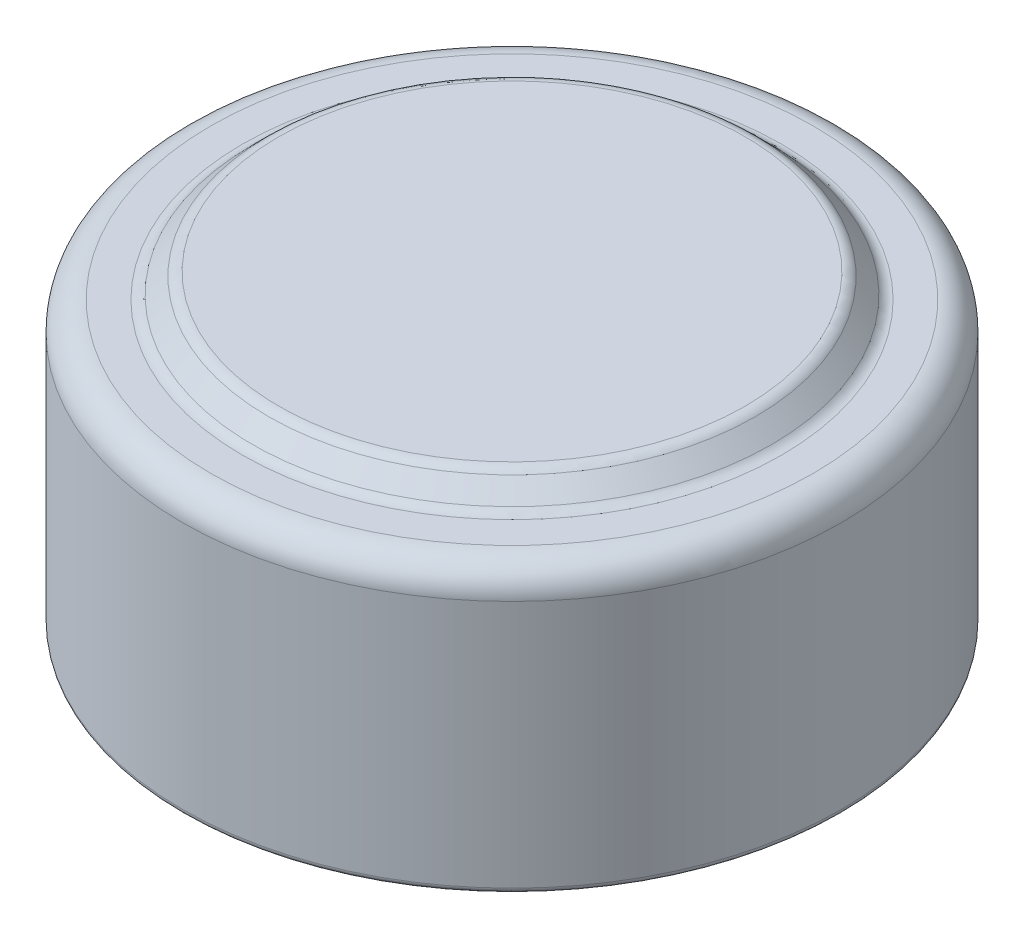
ISO-10303-21;
HEADER;
FILE_DESCRIPTION(('STEP AP214'),'2;1');
FILE_NAME('part.step','',(''),(''),'','','');
FILE_SCHEMA(('AUTOMOTIVE_DESIGN { 1 0 10303 214 1 1 1 1 }'));
ENDSEC;
DATA;
#1=APPLICATION_CONTEXT('core data for automotive mechanical design processes');
#2=APPLICATION_PROTOCOL_DEFINITION('international standard','automotive_design',2000,#1);
#3=PRODUCT_CONTEXT('',#1,'mechanical');
#4=PRODUCT('Part','Part','',(#3));
#5=PRODUCT_RELATED_PRODUCT_CATEGORY('part','',(#4));
#6=PRODUCT_DEFINITION_FORMATION('','',#4);
#7=PRODUCT_DEFINITION_CONTEXT('part definition',#1,'design');
#8=PRODUCT_DEFINITION('design','',#6,#7);
#9=PRODUCT_DEFINITION_SHAPE('','',#8);
#10=(LENGTH_UNIT() NAMED_UNIT(*) SI_UNIT(.MILLI.,.METRE.));
#11=(NAMED_UNIT(*) PLANE_ANGLE_UNIT() SI_UNIT($,.RADIAN.));
#12=(NAMED_UNIT(*) SI_UNIT($,.STERADIAN.) SOLID_ANGLE_UNIT());
#13=UNCERTAINTY_MEASURE_WITH_UNIT(LENGTH_MEASURE(1.E-05),#10,'distance_accuracy_value','');
#14=(GEOMETRIC_REPRESENTATION_CONTEXT(3) GLOBAL_UNCERTAINTY_ASSIGNED_CONTEXT((#13)) GLOBAL_UNIT_ASSIGNED_CONTEXT((#10,
#11,#12)) REPRESENTATION_CONTEXT('',''));
#15=CARTESIAN_POINT('',(0.,0.,0.));
#16=DIRECTION('',(0.,0.,1.));
#17=DIRECTION('',(1.,0.,0.));
#18=AXIS2_PLACEMENT_3D('',#15,#16,#17);
#19=CARTESIAN_POINT('',(0.,0.,0.));
#20=DIRECTION('',(0.,-1.,0.));
#21=DIRECTION('',(1.,0.,0.));
#22=AXIS2_PLACEMENT_3D('',#19,#20,#21);
#23=PLANE('',#22);
#24=DIRECTION('',(-1.,0.,0.));
#25=VECTOR('',#24,1.);
#26=CARTESIAN_POINT('',(-0.25,0.,2.));
#27=LINE('',#26,#25);
#28=CARTESIAN_POINT('',(0.25,0.,2.));
#29=VERTEX_POINT('',#28);
#30=CARTESIAN_POINT('',(-0.25,0.,2.));
#31=VERTEX_POINT('',#30);
#32=EDGE_CURVE('E1611',#29,#31,#27,.T.);
#33=ORIENTED_EDGE('',*,*,#32,.T.);
#34=DIRECTION('',(0.,0.,-1.));
#35=VECTOR('',#34,1.);
#36=CARTESIAN_POINT('',(-0.25,0.,2.));
#37=LINE('',#36,#35);
#38=CARTESIAN_POINT('',(-0.25,0.,0.25));
#39=VERTEX_POINT('',#38);
#40=EDGE_CURVE('E13',#31,#39,#37,.T.);
#41=ORIENTED_EDGE('',*,*,#40,.T.);
#42=DIRECTION('',(-1.,0.,0.));
#43=VECTOR('',#42,1.);
#44=CARTESIAN_POINT('',(-2.,0.,0.25));
#45=LINE('',#44,#43);
#46=CARTESIAN_POINT('',(-2.,0.,0.25));
#47=VERTEX_POINT('',#46);
#48=EDGE_CURVE('E1238',#39,#47,#45,.T.);
#49=ORIENTED_EDGE('',*,*,#48,.T.);
#50=DIRECTION('',(0.,0.,-1.));
#51=VECTOR('',#50,1.);
#52=CARTESIAN_POINT('',(-2.,0.,0.25));
#53=LINE('',#52,#51);
#54=CARTESIAN_POINT('',(-2.,0.,-0.25));
#55=VERTEX_POINT('',#54);
#56=EDGE_CURVE('E1638',#47,#55,#53,.T.);
#57=ORIENTED_EDGE('',*,*,#56,.T.);
#58=DIRECTION('',(1.,0.,0.));
#59=VECTOR('',#58,1.);
#60=CARTESIAN_POINT('',(-2.,0.,-0.25));
#61=LINE('',#60,#59);
#62=CARTESIAN_POINT('',(-0.25,0.,-0.25));
#63=VERTEX_POINT('',#62);
#64=EDGE_CURVE('E1635',#55,#63,#61,.T.);
#65=ORIENTED_EDGE('',*,*,#64,.T.);
#66=DIRECTION('',(0.,0.,-1.));
#67=VECTOR('',#66,1.);
#68=CARTESIAN_POINT('',(-0.25,0.,-0.25));
#69=LINE('',#68,#67);
#70=CARTESIAN_POINT('',(-0.25,0.,-2.));
#71=VERTEX_POINT('',#70);
#72=EDGE_CURVE('E1632',#63,#71,#69,.T.);
#73=ORIENTED_EDGE('',*,*,#72,.T.);
#74=DIRECTION('',(1.,0.,0.));
#75=VECTOR('',#74,1.);
#76=CARTESIAN_POINT('',(-0.25,0.,-2.));
#77=LINE('',#76,#75);
#78=CARTESIAN_POINT('',(0.25,0.,-2.));
#79=VERTEX_POINT('',#78);
#80=EDGE_CURVE('E1629',#71,#79,#77,.T.);
#81=ORIENTED_EDGE('',*,*,#80,.T.);
#82=DIRECTION('',(0.,0.,1.));
#83=VECTOR('',#82,1.);
#84=CARTESIAN_POINT('',(0.25,0.,-0.25));
#85=LINE('',#84,#83);
#86=CARTESIAN_POINT('',(0.25,0.,-0.25));
#87=VERTEX_POINT('',#86);
#88=EDGE_CURVE('E1626',#79,#87,#85,.T.);
#89=ORIENTED_EDGE('',*,*,#88,.T.);
#90=DIRECTION('',(1.,0.,0.));
#91=VECTOR('',#90,1.);
#92=CARTESIAN_POINT('',(0.25,0.,-0.25));
#93=LINE('',#92,#91);
#94=CARTESIAN_POINT('',(2.,0.,-0.25));
#95=VERTEX_POINT('',#94);
#96=EDGE_CURVE('E1623',#87,#95,#93,.T.);
#97=ORIENTED_EDGE('',*,*,#96,.T.);
#98=DIRECTION('',(0.,0.,1.));
#99=VECTOR('',#98,1.);
#100=CARTESIAN_POINT('',(2.,0.,0.25));
#101=LINE('',#100,#99);
#102=CARTESIAN_POINT('',(2.,0.,0.25));
#103=VERTEX_POINT('',#102);
#104=EDGE_CURVE('E1620',#95,#103,#101,.T.);
#105=ORIENTED_EDGE('',*,*,#104,.T.);
#106=DIRECTION('',(-1.,0.,0.));
#107=VECTOR('',#106,1.);
#108=CARTESIAN_POINT('',(0.25,0.,0.25));
#109=LINE('',#108,#107);
#110=CARTESIAN_POINT('',(0.25,0.,0.25));
#111=VERTEX_POINT('',#110);
#112=EDGE_CURVE('E1617',#103,#111,#109,.T.);
#113=ORIENTED_EDGE('',*,*,#112,.T.);
#114=DIRECTION('',(0.,0.,1.));
#115=VECTOR('',#114,1.);
#116=CARTESIAN_POINT('',(0.25,0.,2.));
#117=LINE('',#116,#115);
#118=EDGE_CURVE('E1614',#111,#29,#117,.T.);
#119=ORIENTED_EDGE('',*,*,#118,.T.);
#120=EDGE_LOOP('',(#33,#41,#49,#57,#65,#73,#81,#89,#97,#105,#113,#119));
#121=FACE_BOUND('',#120,.T.);
#122=ADVANCED_FACE('F1229',(#121),#23,.T.);
#123=ORIENTED_EDGE('',*,*,#40,.F.);
#124=ORIENTED_EDGE('',*,*,#32,.F.);
#125=ORIENTED_EDGE('',*,*,#118,.F.);
#126=ORIENTED_EDGE('',*,*,#112,.F.);
#127=ORIENTED_EDGE('',*,*,#104,.F.);
#128=ORIENTED_EDGE('',*,*,#96,.F.);
#129=ORIENTED_EDGE('',*,*,#88,.F.);
#130=ORIENTED_EDGE('',*,*,#80,.F.);
#131=ORIENTED_EDGE('',*,*,#72,.F.);
#132=ORIENTED_EDGE('',*,*,#64,.F.);
#133=ORIENTED_EDGE('',*,*,#56,.F.);
#134=ORIENTED_EDGE('',*,*,#48,.F.);
#135=EDGE_LOOP('',(#123,#124,#125,#126,#127,#128,#129,#130,#131,#132,#133,#134));
#136=FACE_BOUND('',#135,.T.);
#137=DIRECTION('',(-0.995540464166135,0.,-0.0943354875318707));
#138=VECTOR('',#137,1.);
#139=CARTESIAN_POINT('',(-0.579137112303286,0.,3.93981514695249));
#140=LINE('',#139,#138);
#141=CARTESIAN_POINT('',(-0.579137112303286,0.,3.93981514695249));
#142=VERTEX_POINT('',#141);
#143=CARTESIAN_POINT('',(-0.67849608666226,0.,3.93040008284993));
#144=VERTEX_POINT('',#143);
#145=EDGE_CURVE('E1517',#142,#144,#140,.T.);
#146=ORIENTED_EDGE('',*,*,#145,.T.);
#147=DIRECTION('',(-0.0958308297289828,0.,0.995397635155647));
#148=VECTOR('',#147,1.);
#149=CARTESIAN_POINT('',(-0.67849608666226,0.,3.93040008284993));
#150=LINE('',#149,#148);
#151=CARTESIAN_POINT('',(-0.774249291790466,0.,4.92499142900377));
#152=VERTEX_POINT('',#151);
#153=EDGE_CURVE('E1563',#144,#152,#150,.T.);
#154=ORIENTED_EDGE('',*,*,#153,.T.);
#155=DIRECTION('',(0.995418244796923,0.,0.0956165149198263));
#156=VECTOR('',#155,1.);
#157=CARTESIAN_POINT('',(-0.774249291790466,0.,4.92499142900377));
#158=LINE('',#157,#156);
#159=CARTESIAN_POINT('',(-0.576132304610978,0.,4.94402187772172));
#160=VERTEX_POINT('',#159);
#161=EDGE_CURVE('E1557',#152,#160,#158,.T.);
#162=ORIENTED_EDGE('',*,*,#161,.T.);
#163=CARTESIAN_POINT('',(-0.576132304610978,0.,4.94402187772172));
#164=CARTESIAN_POINT('',(-0.562848063113638,0.,4.94526764360899));
#165=CARTESIAN_POINT('',(-0.537428066731086,0.,4.94765147292693));
#166=CARTESIAN_POINT('',(-0.500955931397643,0.,4.95037639883472));
#167=CARTESIAN_POINT('',(-0.467777907571374,0.,4.95269989612441));
#168=CARTESIAN_POINT('',(-0.437923433262967,0.,4.95408980892578));
#169=CARTESIAN_POINT('',(-0.41127038551046,0.,4.95478894246751));
#170=CARTESIAN_POINT('',(-0.387961257945064,0.,4.9545206027815));
#171=CARTESIAN_POINT('',(-0.367891310391459,0.,4.95396066194312));
#172=CARTESIAN_POINT('',(-0.355708054657356,0.,4.95263652042265));
#173=CARTESIAN_POINT('',(-0.35017076614944,0.,4.95203469823454));
#174=B_SPLINE_CURVE_WITH_KNOTS('',3,(#163,#164,#165,#166,#167,#168,#169,#170,#171,#172,#173),
.UNSPECIFIED.,.F.,.F.,(4,1,1,1,1,1,1,1,4),(0.,0.176765299281133,0.33824838769957,
0.484540683418533,0.617383536305086,0.73418831624917,0.837696878102558,0.926233247393305,1.),.UNSPECIFIED.);
#175=CARTESIAN_POINT('',(-0.35017076614944,0.,4.95203469823454));
#176=VERTEX_POINT('',#175);
#177=EDGE_CURVE('E1549',#160,#176,#174,.T.);
#178=ORIENTED_EDGE('',*,*,#177,.T.);
#179=CARTESIAN_POINT('',(-0.35017076614944,0.,4.95203469823454));
#180=CARTESIAN_POINT('',(-0.34273809616172,0.,4.95087510297817));
#181=CARTESIAN_POINT('',(-0.328101930189746,0.,4.9485916666544));
#182=CARTESIAN_POINT('',(-0.306728966277622,0.,4.94331661380554));
#183=CARTESIAN_POINT('',(-0.286260255454316,0.,4.93656739672086));
#184=CARTESIAN_POINT('',(-0.266772228412674,0.,4.92802337936674));
#185=CARTESIAN_POINT('',(-0.248048764176811,0.,4.91828945151708));
#186=CARTESIAN_POINT('',(-0.230346224854302,0.,4.90673222610036));
#187=CARTESIAN_POINT('',(-0.213465975747795,0.,4.89373881107627));
#188=CARTESIAN_POINT('',(-0.19775043201894,0.,4.87909501931557));
#189=CARTESIAN_POINT('',(-0.183054752561447,0.,4.86335310121902));
#190=CARTESIAN_POINT('',(-0.170006725116365,0.,4.84622685891086));
#191=CARTESIAN_POINT('',(-0.158540860090183,0.,4.82801933861695));
#192=CARTESIAN_POINT('',(-0.148938303488982,0.,4.80855361890555));
#193=CARTESIAN_POINT('',(-0.140660521227825,0.,4.78818249208818));
#194=CARTESIAN_POINT('',(-0.134230443257437,0.,4.76658528988735));
#195=CARTESIAN_POINT('',(-0.129666606272355,0.,4.74383268859503));
#196=CARTESIAN_POINT('',(-0.127777184491831,0.,4.72822520828457));
#197=CARTESIAN_POINT('',(-0.126813394354568,0.,4.72026386490121));
#198=B_SPLINE_CURVE_WITH_KNOTS('',3,(#179,#180,#181,#182,#183,#184,#185,#186,#187,#188,#189,
#190,#191,#192,#193,#194,#195,#196,#197),.UNSPECIFIED.,.F.,.F.,(4,1,1,1,1,1,1,1,1,1,1,1,1,1,1,1,
4),(0.,0.0645355136999793,0.127081182288468,0.188695807908852,0.249270302092627,
0.309510450893333,0.369595028291359,0.430461579765324,0.492102849549383,0.553744119333444,
0.615064895075256,0.676599518983968,0.73810745253189,0.801105664637679,0.865107194918374,
0.931191459490145,1.),.UNSPECIFIED.);
#199=CARTESIAN_POINT('',(-0.126813394354568,0.,4.72026386490121));
#200=VERTEX_POINT('',#199);
#201=EDGE_CURVE('E1541',#176,#200,#198,.T.);
#202=ORIENTED_EDGE('',*,*,#201,.T.);
#203=CARTESIAN_POINT('',(-0.126813394354568,0.,4.72026386490121));
#204=CARTESIAN_POINT('',(-0.125984217964188,0.,4.70711045702879));
#205=CARTESIAN_POINT('',(-0.124360629045319,0.,4.68135510808883));
#206=CARTESIAN_POINT('',(-0.128095525414482,0.,4.64342918502035));
#207=CARTESIAN_POINT('',(-0.136765342544982,0.,4.60747873156485));
#208=CARTESIAN_POINT('',(-0.15034614854203,0.,4.57371505268606));
#209=CARTESIAN_POINT('',(-0.168894568379458,0.,4.54277616787755));
#210=CARTESIAN_POINT('',(-0.191839853937776,0.,4.51478873351264));
#211=CARTESIAN_POINT('',(-0.219590675391178,0.,4.49055554112114));
#212=CARTESIAN_POINT('',(-0.246024964797724,0.,4.47321154731204));
#213=CARTESIAN_POINT('',(-0.26947269817296,0.,4.46098748914535));
#214=CARTESIAN_POINT('',(-0.289274132221101,0.,4.45291233535171));
#215=CARTESIAN_POINT('',(-0.310696993447914,0.,4.44524127220123));
#216=CARTESIAN_POINT('',(-0.333992806856697,0.,4.43850671105934));
#217=CARTESIAN_POINT('',(-0.359036647226361,0.,4.43243319715856));
#218=CARTESIAN_POINT('',(-0.385899254801166,0.,4.4276277996647));
#219=CARTESIAN_POINT('',(-0.414460278621418,0.,4.42306459927358));
#220=CARTESIAN_POINT('',(-0.434160400731547,0.,4.42089971050956));
#221=CARTESIAN_POINT('',(-0.444321407175081,0.,4.41978309567044));
#222=B_SPLINE_CURVE_WITH_KNOTS('',3,(#203,#204,#205,#206,#207,#208,#209,#210,#211,#212,#213,
#214,#215,#216,#217,#218,#219,#220,#221),.UNSPECIFIED.,.F.,.F.,(4,1,1,1,1,1,1,1,1,1,1,1,1,1,1,1,
4),(0.,0.0794615546542025,0.155591622131733,0.229016280946953,0.302074873554491,
0.374386787345154,0.445973745701806,0.519654671405812,0.59590417205232,0.636289052151415,
0.67911111824488,0.724882479331101,0.773609703025196,0.825428529069993,0.880376464269299,
0.938300102376877,1.),.UNSPECIFIED.);
#223=CARTESIAN_POINT('',(-0.444321407175081,0.,4.41978309567044));
#224=VERTEX_POINT('',#223);
#225=EDGE_CURVE('E1536',#200,#224,#222,.T.);
#226=ORIENTED_EDGE('',*,*,#225,.T.);
#227=DIRECTION('',(0.684417411691212,0.,-0.729090396709422));
#228=VECTOR('',#227,1.);
#229=CARTESIAN_POINT('',(-0.444321407175081,0.,4.41978309567044));
#230=LINE('',#229,#228);
#231=CARTESIAN_POINT('',(-0.0422781379443117,0.,3.99149783926018));
#232=VERTEX_POINT('',#231);
#233=EDGE_CURVE('E1533',#224,#232,#230,.T.);
#234=ORIENTED_EDGE('',*,*,#233,.T.);
#235=DIRECTION('',(-0.9954149678096,0.,-0.0956506239426177));
#236=VECTOR('',#235,1.);
#237=CARTESIAN_POINT('',(-0.0422781379443117,0.,3.99149783926018));
#238=LINE('',#237,#236);
#239=CARTESIAN_POINT('',(-0.165274932816106,0.,3.97967892900377));
#240=VERTEX_POINT('',#239);
#241=EDGE_CURVE('E1530',#232,#240,#238,.T.);
#242=ORIENTED_EDGE('',*,*,#241,.T.);
#243=DIRECTION('',(-0.6838730169942,0.,0.729601053060678));
#244=VECTOR('',#243,1.);
#245=CARTESIAN_POINT('',(-0.165274932816106,0.,3.97967892900377));
#246=LINE('',#245,#244);
#247=CARTESIAN_POINT('',(-0.566717240508414,0.,4.40796418541403));
#248=VERTEX_POINT('',#247);
#249=EDGE_CURVE('E1527',#240,#248,#246,.T.);
#250=ORIENTED_EDGE('',*,*,#249,.T.);
#251=DIRECTION('',(-0.995175000159784,0.,-0.0981158450861767));
#252=VECTOR('',#251,1.);
#253=CARTESIAN_POINT('',(-0.566717240508414,0.,4.40796418541403));
#254=LINE('',#253,#252);
#255=CARTESIAN_POINT('',(-0.62360826614944,0.,4.40235521105506));
#256=VERTEX_POINT('',#255);
#257=EDGE_CURVE('E1524',#248,#256,#254,.T.);
#258=ORIENTED_EDGE('',*,*,#257,.T.);
#259=DIRECTION('',(0.0957041922041449,0.,-0.995409818916084));
#260=VECTOR('',#259,1.);
#261=CARTESIAN_POINT('',(-0.62360826614944,0.,4.40235521105506));
#262=LINE('',#261,#260);
#263=EDGE_CURVE('E1521',#256,#142,#262,.T.);
#264=ORIENTED_EDGE('',*,*,#263,.T.);
#265=EDGE_LOOP('',(#146,#154,#162,#178,#202,#226,#234,#242,#250,#258,#264));
#266=FACE_BOUND('',#265,.T.);
#267=DIRECTION('',(-0.955815530348748,0.,0.293967127318925));
#268=VECTOR('',#267,1.);
#269=CARTESIAN_POINT('',(1.35736434889878,0.,3.9895496881155));
#270=LINE('',#269,#268);
#271=CARTESIAN_POINT('',(1.35736434889878,0.,3.9895496881155));
#272=VERTEX_POINT('',#271);
#273=CARTESIAN_POINT('',(0.904039028385959,0.,4.12897276503858));
#274=VERTEX_POINT('',#273);
#275=EDGE_CURVE('E1426',#272,#274,#270,.T.);
#276=ORIENTED_EDGE('',*,*,#275,.T.);
#277=DIRECTION('',(0.790349486385174,0.,0.61265625710564));
#278=VECTOR('',#277,1.);
#279=CARTESIAN_POINT('',(0.904039028385959,0.,4.12897276503858));
#280=LINE('',#279,#278);
#281=CARTESIAN_POINT('',(1.66405505402698,0.,4.7181153932437));
#282=VERTEX_POINT('',#281);
#283=EDGE_CURVE('E1433',#274,#282,#280,.T.);
#284=ORIENTED_EDGE('',*,*,#283,.T.);
#285=DIRECTION('',(0.95447997803502,0.,-0.298274993135977));
#286=VECTOR('',#285,1.);
#287=CARTESIAN_POINT('',(1.66405505402698,0.,4.7181153932437));
#288=LINE('',#287,#286);
#289=CARTESIAN_POINT('',(1.68328582325775,0.,4.71210577785909));
#290=VERTEX_POINT('',#289);
#291=EDGE_CURVE('E1461',#282,#290,#288,.T.);
#292=ORIENTED_EDGE('',*,*,#291,.T.);
#293=DIRECTION('',(-0.29406549008956,0.,-0.955785272714738));
#294=VECTOR('',#293,1.);
#295=CARTESIAN_POINT('',(1.68328582325775,0.,4.71210577785909));
#296=LINE('',#295,#294);
#297=CARTESIAN_POINT('',(1.47996050274493,0.,4.05124840606422));
#298=VERTEX_POINT('',#297);
#299=EDGE_CURVE('E1458',#290,#298,#296,.T.);
#300=ORIENTED_EDGE('',*,*,#299,.T.);
#301=DIRECTION('',(0.955923177176651,0.,-0.293616892117088));
#302=VECTOR('',#301,1.);
#303=CARTESIAN_POINT('',(1.47996050274493,0.,4.05124840606422));
#304=LINE('',#303,#302);
#305=CARTESIAN_POINT('',(1.59474415659109,0.,4.01599199580781));
#306=VERTEX_POINT('',#305);
#307=EDGE_CURVE('E1455',#298,#306,#304,.T.);
#308=ORIENTED_EDGE('',*,*,#307,.T.);
#309=DIRECTION('',(-0.292753571503899,0.,-0.956187924192578));
#310=VECTOR('',#309,1.);
#311=CARTESIAN_POINT('',(1.59474415659109,0.,4.01599199580781));
#312=LINE('',#311,#310);
#313=CARTESIAN_POINT('',(1.56689960530904,0.,3.92504648298729));
#314=VERTEX_POINT('',#313);
#315=EDGE_CURVE('E1452',#306,#314,#312,.T.);
#316=ORIENTED_EDGE('',*,*,#315,.T.);
#317=DIRECTION('',(-0.955923177176653,0.,0.293616892117082));
#318=VECTOR('',#317,1.);
#319=CARTESIAN_POINT('',(1.56689960530904,0.,3.92504648298729));
#320=LINE('',#319,#318);
#321=CARTESIAN_POINT('',(1.45211595146288,0.,3.9603028932437));
#322=VERTEX_POINT('',#321);
#323=EDGE_CURVE('E1449',#314,#322,#320,.T.);
#324=ORIENTED_EDGE('',*,*,#323,.T.);
#325=DIRECTION('',(-0.294268837701824,0.,-0.955722685279374));
#326=VECTOR('',#325,1.);
#327=CARTESIAN_POINT('',(1.45211595146288,0.,3.9603028932437));
#328=LINE('',#327,#326);
#329=CARTESIAN_POINT('',(1.38420729761673,0.,3.73975000862832));
#330=VERTEX_POINT('',#329);
#331=EDGE_CURVE('E1446',#322,#330,#328,.T.);
#332=ORIENTED_EDGE('',*,*,#331,.T.);
#333=DIRECTION('',(-0.955516559654642,0.,0.294937458159787));
#334=VECTOR('',#333,1.);
#335=CARTESIAN_POINT('',(1.38420729761673,0.,3.73975000862832));
#336=LINE('',#335,#334);
#337=CARTESIAN_POINT('',(1.28945569505263,0.,3.76899680350011));
#338=VERTEX_POINT('',#337);
#339=EDGE_CURVE('E1428',#330,#338,#336,.T.);
#340=ORIENTED_EDGE('',*,*,#339,.T.);
#341=DIRECTION('',(0.294268837701825,0.,0.955722685279374));
#342=VECTOR('',#341,1.);
#343=CARTESIAN_POINT('',(1.28945569505263,0.,3.76899680350011));
#344=LINE('',#343,#342);
#345=EDGE_CURVE('E1422',#338,#272,#344,.T.);
#346=ORIENTED_EDGE('',*,*,#345,.T.);
#347=EDGE_LOOP('',(#276,#284,#292,#300,#308,#316,#324,#332,#340,#346));
#348=FACE_BOUND('',#347,.T.);
#349=CARTESIAN_POINT('',(0.,0.,0.));
#350=DIRECTION('',(0.,1.,0.));
#351=DIRECTION('',(-1.,0.,0.));
#352=AXIS2_PLACEMENT_3D('',#349,#350,#351);
#353=CIRCLE('',#352,5.7);
#354=CARTESIAN_POINT('',(-5.7,0.,0.));
#355=VERTEX_POINT('',#354);
#356=EDGE_CURVE('E1435',#355,#355,#353,.T.);
#357=ORIENTED_EDGE('',*,*,#356,.F.);
#358=EDGE_LOOP('',(#357));
#359=FACE_BOUND('',#358,.T.);
#360=DIRECTION('',(-0.994526294566502,0.,0.104486599216473));
#361=VECTOR('',#360,1.);
#362=CARTESIAN_POINT('',(0.566861467099969,0.,4.1759104752558));
#363=LINE('',#362,#361);
#364=CARTESIAN_POINT('',(0.566861467099969,0.,4.1759104752558));
#365=VERTEX_POINT('',#364);
#366=CARTESIAN_POINT('',(0.0959079414589436,0.,4.22538964192246));
#367=VERTEX_POINT('',#366);
#368=EDGE_CURVE('E1476',#365,#367,#363,.T.);
#369=ORIENTED_EDGE('',*,*,#368,.T.);
#370=DIRECTION('',(0.657706516535951,0.,0.753274278139208));
#371=VECTOR('',#370,1.);
#372=CARTESIAN_POINT('',(0.0959079414589436,0.,4.22538964192246));
#373=LINE('',#372,#371);
#374=CARTESIAN_POINT('',(0.7273181978692,0.,4.94854669320451));
#375=VERTEX_POINT('',#374);
#376=EDGE_CURVE('E1504',#367,#375,#373,.T.);
#377=ORIENTED_EDGE('',*,*,#376,.T.);
#378=DIRECTION('',(0.994004355935433,0.,-0.109340479152896));
#379=VECTOR('',#378,1.);
#380=CARTESIAN_POINT('',(0.7273181978692,0.,4.94854669320451));
#381=LINE('',#380,#379);
#382=CARTESIAN_POINT('',(0.747350249151251,0.,4.94634316756349));
#383=VERTEX_POINT('',#382);
#384=EDGE_CURVE('E1501',#375,#383,#381,.T.);
#385=ORIENTED_EDGE('',*,*,#384,.T.);
#386=DIRECTION('',(-0.10447329131765,0.,-0.994527692626634));
#387=VECTOR('',#386,1.);
#388=CARTESIAN_POINT('',(0.747350249151251,0.,4.94634316756349));
#389=LINE('',#388,#387);
#390=CARTESIAN_POINT('',(0.675234864535867,0.,4.25984477012759));
#391=VERTEX_POINT('',#390);
#392=EDGE_CURVE('E1498',#383,#391,#389,.T.);
#393=ORIENTED_EDGE('',*,*,#392,.T.);
#394=DIRECTION('',(0.994614819583192,0.,-0.103640535822116));
#395=VECTOR('',#394,1.);
#396=CARTESIAN_POINT('',(0.675234864535867,0.,4.25984477012759));
#397=LINE('',#396,#395);
#398=CARTESIAN_POINT('',(0.794425569664072,0.,4.24742489833272));
#399=VERTEX_POINT('',#398);
#400=EDGE_CURVE('E1495',#391,#399,#397,.T.);
#401=ORIENTED_EDGE('',*,*,#400,.T.);
#402=DIRECTION('',(-0.105563961257722,0.,-0.994412515047743));
#403=VECTOR('',#402,1.);
#404=CARTESIAN_POINT('',(0.794425569664072,0.,4.24742489833272));
#405=LINE('',#404,#403);
#406=CARTESIAN_POINT('',(0.784409544023046,0.,4.15307393679426));
#407=VERTEX_POINT('',#406);
#408=EDGE_CURVE('E1492',#399,#407,#405,.T.);
#409=ORIENTED_EDGE('',*,*,#408,.T.);
#410=DIRECTION('',(-0.994614819583192,0.,0.103640535822116));
#411=VECTOR('',#410,1.);
#412=CARTESIAN_POINT('',(0.784409544023046,0.,4.15307393679426));
#413=LINE('',#412,#411);
#414=CARTESIAN_POINT('',(0.665218838894841,0.,4.16549380858913));
#415=VERTEX_POINT('',#414);
#416=EDGE_CURVE('E1489',#407,#415,#413,.T.);
#417=ORIENTED_EDGE('',*,*,#416,.T.);
#418=DIRECTION('',(-0.104322744313672,0.,-0.994543495790337));
#419=VECTOR('',#418,1.);
#420=CARTESIAN_POINT('',(0.665218838894841,0.,4.16549380858913));
#421=LINE('',#420,#419);
#422=CARTESIAN_POINT('',(0.64118037735638,0.,3.93632714192246));
#423=VERTEX_POINT('',#422);
#424=EDGE_CURVE('E1486',#415,#423,#421,.T.);
#425=ORIENTED_EDGE('',*,*,#424,.T.);
#426=DIRECTION('',(-0.994438665442402,0.,0.105317333203673));
#427=VECTOR('',#426,1.);
#428=CARTESIAN_POINT('',(0.64118037735638,0.,3.93632714192246));
#429=LINE('',#428,#427);
#430=CARTESIAN_POINT('',(0.542823005561508,0.,3.94674380858913));
#431=VERTEX_POINT('',#430);
#432=EDGE_CURVE('E1483',#423,#431,#429,.T.);
#433=ORIENTED_EDGE('',*,*,#432,.T.);
#434=DIRECTION('',(0.104322744313672,0.,0.994543495790337));
#435=VECTOR('',#434,1.);
#436=CARTESIAN_POINT('',(0.542823005561508,0.,3.94674380858913));
#437=LINE('',#436,#435);
#438=EDGE_CURVE('E1480',#431,#365,#437,.T.);
#439=ORIENTED_EDGE('',*,*,#438,.T.);
#440=EDGE_LOOP('',(#369,#377,#385,#393,#401,#409,#417,#425,#433,#439));
#441=FACE_BOUND('',#440,.T.);
#442=DIRECTION('',(-0.960310420702971,0.,-0.278933497252093));
#443=VECTOR('',#442,1.);
#444=CARTESIAN_POINT('',(-0.838450131693838,0.,3.90844661902257));
#445=LINE('',#444,#443);
#446=CARTESIAN_POINT('',(-0.838450131693838,0.,3.90844661902257));
#447=VERTEX_POINT('',#446);
#448=CARTESIAN_POINT('',(-1.30259275989897,0.,3.77363091389436));
#449=VERTEX_POINT('',#448);
#450=EDGE_CURVE('E1592',#447,#449,#445,.T.);
#451=ORIENTED_EDGE('',*,*,#450,.T.);
#452=DIRECTION('',(-0.278989457181773,0.,0.960294164712782));
#453=VECTOR('',#452,1.);
#454=CARTESIAN_POINT('',(-1.30259275989897,0.,3.77363091389436));
#455=LINE('',#454,#453);
#456=CARTESIAN_POINT('',(-1.58083795220666,0.,4.73136328568924));
#457=VERTEX_POINT('',#456);
#458=EDGE_CURVE('E1608',#449,#457,#455,.T.);
#459=ORIENTED_EDGE('',*,*,#458,.T.);
#460=DIRECTION('',(0.960156349544876,0.,0.279463386561921));
#461=VECTOR('',#460,1.);
#462=CARTESIAN_POINT('',(-1.58083795220666,0.,4.73136328568924));
#463=LINE('',#462,#461);
#464=CARTESIAN_POINT('',(-1.48448378553999,0.,4.75940815748411));
#465=VERTEX_POINT('',#464);
#466=EDGE_CURVE('E1605',#457,#465,#463,.T.);
#467=ORIENTED_EDGE('',*,*,#466,.T.);
#468=DIRECTION('',(0.279035086455506,0.,-0.960280907092695));
#469=VECTOR('',#468,1.);
#470=CARTESIAN_POINT('',(-1.48448378553999,0.,4.75940815748411));
#471=LINE('',#470,#469);
#472=CARTESIAN_POINT('',(-1.23308154195025,0.,3.89422386261231));
#473=VERTEX_POINT('',#472);
#474=EDGE_CURVE('E1602',#465,#473,#471,.T.);
#475=ORIENTED_EDGE('',*,*,#474,.T.);
#476=DIRECTION('',(0.960350744479453,0.,0.278794633337446));
#477=VECTOR('',#476,1.);
#478=CARTESIAN_POINT('',(-1.23308154195025,0.,3.89422386261231));
#479=LINE('',#478,#477);
#480=CARTESIAN_POINT('',(-0.865293080411787,0.,4.00099469594565));
#481=VERTEX_POINT('',#480);
#482=EDGE_CURVE('E1599',#473,#481,#479,.T.);
#483=ORIENTED_EDGE('',*,*,#482,.T.);
#484=DIRECTION('',(0.278562801225232,0.,-0.960418016164603));
#485=VECTOR('',#484,1.);
#486=CARTESIAN_POINT('',(-0.865293080411787,0.,4.00099469594565));
#487=LINE('',#486,#485);
#488=EDGE_CURVE('E1596',#481,#447,#487,.T.);
#489=ORIENTED_EDGE('',*,*,#488,.T.);
#490=EDGE_LOOP('',(#451,#459,#467,#475,#483,#489));
#491=FACE_BOUND('',#490,.T.);
#492=ADVANCED_FACE('F1424',(#136,#266,#348,#359,#441,#491),#23,.T.);
#493=CARTESIAN_POINT('',(-0.230178778969953,0.,4.71044815977301));
#494=CARTESIAN_POINT('',(-0.231255144611384,0.,4.71858277520208));
#495=CARTESIAN_POINT('',(-0.233383409842668,0.,4.73466710428243));
#496=CARTESIAN_POINT('',(-0.241095048806678,0.,4.75770838211113));
#497=CARTESIAN_POINT('',(-0.251717095791402,0.,4.77934514294086));
#498=CARTESIAN_POINT('',(-0.265593920538264,0.,4.79911905853938));
#499=CARTESIAN_POINT('',(-0.281828967347683,0.,4.81659659267776));
#500=CARTESIAN_POINT('',(-0.300163864511207,0.,4.83140847635024));
#501=CARTESIAN_POINT('',(-0.32050730259715,0.,4.84280648993923));
#502=CARTESIAN_POINT('',(-0.33903018687898,0.,4.84977291810663));
#503=CARTESIAN_POINT('',(-0.355326655854572,0.,4.85381819014929));
#504=CARTESIAN_POINT('',(-0.369492412813922,0.,4.85583674897022));
#505=CARTESIAN_POINT('',(-0.385324280906283,0.,4.8574908826903));
#506=CARTESIAN_POINT('',(-0.402914591428917,0.,4.85824502295578));
#507=CARTESIAN_POINT('',(-0.42228988203665,0.,4.85814387193637));
#508=CARTESIAN_POINT('',(-0.443470730197714,0.,4.85760436778251));
#509=CARTESIAN_POINT('',(-0.466374332062692,0.,4.85611224324657));
#510=CARTESIAN_POINT('',(-0.482184351105255,0.,4.85477332247248));
#511=CARTESIAN_POINT('',(-0.490395125123799,0.,4.85407796746531));
#512=B_SPLINE_CURVE_WITH_KNOTS('',3,(#493,#494,#495,#496,#497,#498,#499,#500,#501,#502,#503,
#504,#505,#506,#507,#508,#509,#510,#511),.UNSPECIFIED.,.F.,.F.,(4,1,1,1,1,1,1,1,1,1,1,1,1,1,1,1,
4),(0.,0.0724675297644333,0.143287855035502,0.213843929047571,0.285148211735842,
0.356221981643797,0.424325497872823,0.492853211805695,0.561665654074248,0.598783575014046,
0.641237133800842,0.688156014974288,0.73961756872597,0.79693369571213,0.85959289370472,
0.927080984704404,1.),.UNSPECIFIED.);
#513=CARTESIAN_POINT('',(-0.230178778969953,0.,4.71044815977301));
#514=VERTEX_POINT('',#513);
#515=CARTESIAN_POINT('',(-0.490395125123799,0.,4.85407796746531));
#516=VERTEX_POINT('',#515);
#517=EDGE_CURVE('E1566',#514,#516,#512,.T.);
#518=ORIENTED_EDGE('',*,*,#517,.T.);
#519=DIRECTION('',(-0.995304114629685,0.,-0.0967973109193606));
#520=VECTOR('',#519,1.);
#521=CARTESIAN_POINT('',(-0.490395125123799,0.,4.85407796746531));
#522=LINE('',#521,#520);
#523=CARTESIAN_POINT('',(-0.665475253328927,0.,4.83705072387557));
#524=VERTEX_POINT('',#523);
#525=EDGE_CURVE('E1589',#516,#524,#522,.T.);
#526=ORIENTED_EDGE('',*,*,#525,.T.);
#527=DIRECTION('',(0.095532618839154,0.,-0.995426300003035));
#528=VECTOR('',#527,1.);
#529=CARTESIAN_POINT('',(-0.665475253328927,0.,4.83705072387557));
#530=LINE('',#529,#528);
#531=CARTESIAN_POINT('',(-0.633023330252004,0.,4.49890969823454));
#532=VERTEX_POINT('',#531);
#533=EDGE_CURVE('E1586',#524,#532,#530,.T.);
#534=ORIENTED_EDGE('',*,*,#533,.T.);
#535=DIRECTION('',(0.996072640692687,0.,0.0885397902837909));
#536=VECTOR('',#535,1.);
#537=CARTESIAN_POINT('',(-0.633023330252004,0.,4.49890969823454));
#538=LINE('',#537,#536);
#539=CARTESIAN_POINT('',(-0.461749291790465,0.,4.5141340572089));
#540=VERTEX_POINT('',#539);
#541=EDGE_CURVE('E1580',#532,#540,#538,.T.);
#542=ORIENTED_EDGE('',*,*,#541,.T.);
#543=CARTESIAN_POINT('',(-0.461749291790465,0.,4.5141340572089));
#544=CARTESIAN_POINT('',(-0.453730761834248,0.,4.51495464595747));
#545=CARTESIAN_POINT('',(-0.43827121095068,0.,4.5165367231689));
#546=CARTESIAN_POINT('',(-0.415968780013303,0.,4.51959528200281));
#547=CARTESIAN_POINT('',(-0.395284702377385,0.,4.52286484013474));
#548=CARTESIAN_POINT('',(-0.376300674343713,0.,4.5270152385347));
#549=CARTESIAN_POINT('',(-0.35883455655174,0.,4.53100776307113));
#550=CARTESIAN_POINT('',(-0.343159612514393,0.,4.53590786068545));
#551=CARTESIAN_POINT('',(-0.329130331062661,0.,4.54100745279593));
#552=CARTESIAN_POINT('',(-0.312910231376957,0.,4.54844474005309));
#553=CARTESIAN_POINT('',(-0.294865562096881,0.,4.55934378816566));
#554=CARTESIAN_POINT('',(-0.276104389561416,0.,4.57527713480678));
#555=CARTESIAN_POINT('',(-0.260216833155444,0.,4.59380508295944));
#556=CARTESIAN_POINT('',(-0.247444202882351,0.,4.61465614533721));
#557=CARTESIAN_POINT('',(-0.237875613731764,0.,4.63723768605345));
#558=CARTESIAN_POINT('',(-0.231636767728539,0.,4.66090462481005));
#559=CARTESIAN_POINT('',(-0.228595496048112,0.,4.6854830557811));
#560=CARTESIAN_POINT('',(-0.229645010833553,0.,4.70203173788848));
#561=CARTESIAN_POINT('',(-0.230178778969953,0.,4.71044815977301));
#562=B_SPLINE_CURVE_WITH_KNOTS('',3,(#543,#544,#545,#546,#547,#548,#549,#550,#551,#552,#553,
#554,#555,#556,#557,#558,#559,#560,#561),.UNSPECIFIED.,.F.,.F.,(4,1,1,1,1,1,1,1,1,1,1,1,1,1,1,1,
4),(0.,0.069852556374852,0.13467420531203,0.195088656496428,0.25127206876277,0.303066574241626,
0.350295117201156,0.393509549825942,0.432352734578977,0.504805898308519,0.57542379556649,
0.64478557848861,0.715455625521728,0.786506149065074,0.856552617668173,0.927044722951207,1.),.UNSPECIFIED.);
#563=EDGE_CURVE('E1572',#540,#514,#562,.T.);
#564=ORIENTED_EDGE('',*,*,#563,.T.);
#565=EDGE_LOOP('',(#518,#526,#534,#542,#564));
#566=FACE_BOUND('',#565,.T.);
#567=ADVANCED_FACE('F1771',(#566),#23,.T.);
#568=ORIENTED_EDGE('',*,*,#458,.F.);
#569=ORIENTED_EDGE('',*,*,#450,.F.);
#570=ORIENTED_EDGE('',*,*,#488,.F.);
#571=ORIENTED_EDGE('',*,*,#482,.F.);
#572=ORIENTED_EDGE('',*,*,#474,.F.);
#573=ORIENTED_EDGE('',*,*,#466,.F.);
#574=EDGE_LOOP('',(#568,#569,#570,#571,#572,#573));
#575=FACE_BOUND('',#574,.T.);
#576=ADVANCED_FACE('F1794',(#575),#23,.T.);
#577=DIRECTION('',(-0.659009450390536,0.,-0.752134658353119));
#578=VECTOR('',#577,1.);
#579=CARTESIAN_POINT('',(0.619946402997405,0.,4.68091848807631));
#580=LINE('',#579,#578);
#581=CARTESIAN_POINT('',(0.619946402997405,0.,4.68091848807631));
#582=VERTEX_POINT('',#581);
#583=CARTESIAN_POINT('',(0.286813390176892,0.,4.30071015474298));
#584=VERTEX_POINT('',#583);
#585=EDGE_CURVE('E1507',#582,#584,#580,.T.);
#586=ORIENTED_EDGE('',*,*,#585,.T.);
#587=DIRECTION('',(0.994535519578926,0.,-0.104398756198895));
#588=VECTOR('',#587,1.);
#589=CARTESIAN_POINT('',(0.286813390176892,0.,4.30071015474298));
#590=LINE('',#589,#588);
#591=CARTESIAN_POINT('',(0.576877492740995,0.,4.27026143679426));
#592=VERTEX_POINT('',#591);
#593=EDGE_CURVE('E1514',#584,#592,#590,.T.);
#594=ORIENTED_EDGE('',*,*,#593,.T.);
#595=DIRECTION('',(0.104305965834117,0.,0.994545255627622));
#596=VECTOR('',#595,1.);
#597=CARTESIAN_POINT('',(0.576877492740995,0.,4.27026143679426));
#598=LINE('',#597,#596);
#599=EDGE_CURVE('E1511',#592,#582,#598,.T.);
#600=ORIENTED_EDGE('',*,*,#599,.T.);
#601=EDGE_LOOP('',(#586,#594,#600));
#602=FACE_BOUND('',#601,.T.);
#603=ADVANCED_FACE('F1786',(#602),#23,.T.);
#604=ORIENTED_EDGE('',*,*,#525,.F.);
#605=ORIENTED_EDGE('',*,*,#517,.F.);
#606=ORIENTED_EDGE('',*,*,#563,.F.);
#607=ORIENTED_EDGE('',*,*,#541,.F.);
#608=ORIENTED_EDGE('',*,*,#533,.F.);
#609=EDGE_LOOP('',(#604,#605,#606,#607,#608));
#610=FACE_BOUND('',#609,.T.);
#611=ORIENTED_EDGE('',*,*,#153,.F.);
#612=ORIENTED_EDGE('',*,*,#145,.F.);
#613=ORIENTED_EDGE('',*,*,#263,.F.);
#614=ORIENTED_EDGE('',*,*,#257,.F.);
#615=ORIENTED_EDGE('',*,*,#249,.F.);
#616=ORIENTED_EDGE('',*,*,#241,.F.);
#617=ORIENTED_EDGE('',*,*,#233,.F.);
#618=ORIENTED_EDGE('',*,*,#225,.F.);
#619=ORIENTED_EDGE('',*,*,#201,.F.);
#620=ORIENTED_EDGE('',*,*,#177,.F.);
#621=ORIENTED_EDGE('',*,*,#161,.F.);
#622=EDGE_LOOP('',(#611,#612,#613,#614,#615,#616,#617,#618,#619,#620,#621));
#623=FACE_BOUND('',#622,.T.);
#624=ADVANCED_FACE('F1776',(#610,#623),#23,.T.);
#625=DIRECTION('',(-0.791519824016576,0.,-0.611143492306651));
#626=VECTOR('',#625,1.);
#627=CARTESIAN_POINT('',(1.50680345146288,0.,4.47572757273088));
#628=LINE('',#627,#626);
#629=CARTESIAN_POINT('',(1.50680345146288,0.,4.47572757273088));
#630=VERTEX_POINT('',#629);
#631=CARTESIAN_POINT('',(1.10596210530904,0.,4.16623238042319));
#632=VERTEX_POINT('',#631);
#633=EDGE_CURVE('E1466',#630,#632,#628,.T.);
#634=ORIENTED_EDGE('',*,*,#633,.T.);
#635=DIRECTION('',(0.955956762071702,0.,-0.293507528096619));
#636=VECTOR('',#635,1.);
#637=CARTESIAN_POINT('',(1.10596210530904,0.,4.16623238042319));
#638=LINE('',#637,#636);
#639=CARTESIAN_POINT('',(1.38520890018083,0.,4.08049520093601));
#640=VERTEX_POINT('',#639);
#641=EDGE_CURVE('E1473',#632,#640,#638,.T.);
#642=ORIENTED_EDGE('',*,*,#641,.T.);
#643=DIRECTION('',(0.294051807300135,0.,0.955789482377539));
#644=VECTOR('',#643,1.);
#645=CARTESIAN_POINT('',(1.38520890018083,0.,4.08049520093601));
#646=LINE('',#645,#644);
#647=EDGE_CURVE('E1470',#640,#630,#646,.T.);
#648=ORIENTED_EDGE('',*,*,#647,.T.);
#649=EDGE_LOOP('',(#634,#642,#648));
#650=FACE_BOUND('',#649,.T.);
#651=ADVANCED_FACE('F1785',(#650),#23,.T.);
#652=ORIENTED_EDGE('',*,*,#593,.F.);
#653=ORIENTED_EDGE('',*,*,#585,.F.);
#654=ORIENTED_EDGE('',*,*,#599,.F.);
#655=EDGE_LOOP('',(#652,#653,#654));
#656=FACE_BOUND('',#655,.T.);
#657=ORIENTED_EDGE('',*,*,#376,.F.);
#658=ORIENTED_EDGE('',*,*,#368,.F.);
#659=ORIENTED_EDGE('',*,*,#438,.F.);
#660=ORIENTED_EDGE('',*,*,#432,.F.);
#661=ORIENTED_EDGE('',*,*,#424,.F.);
#662=ORIENTED_EDGE('',*,*,#416,.F.);
#663=ORIENTED_EDGE('',*,*,#408,.F.);
#664=ORIENTED_EDGE('',*,*,#400,.F.);
#665=ORIENTED_EDGE('',*,*,#392,.F.);
#666=ORIENTED_EDGE('',*,*,#384,.F.);
#667=EDGE_LOOP('',(#657,#658,#659,#660,#661,#662,#663,#664,#665,#666));
#668=FACE_BOUND('',#667,.T.);
#669=ADVANCED_FACE('F1792',(#656,#668),#23,.T.);
#670=ORIENTED_EDGE('',*,*,#641,.F.);
#671=ORIENTED_EDGE('',*,*,#633,.F.);
#672=ORIENTED_EDGE('',*,*,#647,.F.);
#673=EDGE_LOOP('',(#670,#671,#672));
#674=FACE_BOUND('',#673,.T.);
#675=ORIENTED_EDGE('',*,*,#283,.F.);
#676=ORIENTED_EDGE('',*,*,#275,.F.);
#677=ORIENTED_EDGE('',*,*,#345,.F.);
#678=ORIENTED_EDGE('',*,*,#339,.F.);
#679=ORIENTED_EDGE('',*,*,#331,.F.);
#680=ORIENTED_EDGE('',*,*,#323,.F.);
#681=ORIENTED_EDGE('',*,*,#315,.F.);
#682=ORIENTED_EDGE('',*,*,#307,.F.);
#683=ORIENTED_EDGE('',*,*,#299,.F.);
#684=ORIENTED_EDGE('',*,*,#291,.F.);
#685=EDGE_LOOP('',(#675,#676,#677,#678,#679,#680,#681,#682,#683,#684));
#686=FACE_BOUND('',#685,.T.);
#687=ADVANCED_FACE('F1231',(#674,#686),#23,.T.);
#688=CARTESIAN_POINT('',(0.,0.0999999999999993,0.));
#689=DIRECTION('',(0.,1.,0.));
#690=DIRECTION('',(-1.,0.,0.));
#691=AXIS2_PLACEMENT_3D('',#688,#689,#690);
#692=TOROIDAL_SURFACE('',#691,5.7,0.1);
#693=ORIENTED_EDGE('',*,*,#356,.T.);
#694=EDGE_LOOP('',(#693));
#695=FACE_BOUND('',#694,.T.);
#696=CARTESIAN_POINT('',(0.,0.0999999999999994,0.));
#697=DIRECTION('',(0.,1.,0.));
#698=DIRECTION('',(-1.,0.,0.));
#699=AXIS2_PLACEMENT_3D('',#696,#697,#698);
#700=CIRCLE('',#699,5.8);
#701=CARTESIAN_POINT('',(-5.8,0.0999999999999991,0.));
#702=VERTEX_POINT('',#701);
#703=EDGE_CURVE('E1440',#702,#702,#700,.T.);
#704=ORIENTED_EDGE('',*,*,#703,.F.);
#705=EDGE_LOOP('',(#704));
#706=FACE_BOUND('',#705,.T.);
#707=ADVANCED_FACE('F1800',(#695,#706),#692,.T.);
#708=CARTESIAN_POINT('',(0.,5.4,0.));
#709=DIRECTION('',(0.,1.,0.));
#710=DIRECTION('',(-1.,0.,0.));
#711=AXIS2_PLACEMENT_3D('',#708,#709,#710);
#712=CYLINDRICAL_SURFACE('',#711,5.8);
#713=ORIENTED_EDGE('',*,*,#703,.T.);
#714=EDGE_LOOP('',(#713));
#715=FACE_BOUND('',#714,.T.);
#716=CARTESIAN_POINT('',(0.,4.47,0.));
#717=DIRECTION('',(0.,1.,0.));
#718=DIRECTION('',(-1.,0.,0.));
#719=AXIS2_PLACEMENT_3D('',#716,#717,#718);
#720=CIRCLE('',#719,5.8);
#721=CARTESIAN_POINT('',(-5.8,4.47,0.));
#722=VERTEX_POINT('',#721);
#723=EDGE_CURVE('E1938',#722,#722,#720,.T.);
#724=ORIENTED_EDGE('',*,*,#723,.F.);
#725=EDGE_LOOP('',(#724));
#726=FACE_BOUND('',#725,.T.);
#727=ADVANCED_FACE('F1806',(#715,#726),#712,.T.);
#728=CARTESIAN_POINT('',(0.,4.47,0.));
#729=DIRECTION('',(0.,1.,0.));
#730=DIRECTION('',(-1.,0.,0.));
#731=AXIS2_PLACEMENT_3D('',#728,#729,#730);
#732=TOROIDAL_SURFACE('',#731,5.3,0.5);
#733=ORIENTED_EDGE('',*,*,#723,.T.);
#734=EDGE_LOOP('',(#733));
#735=FACE_BOUND('',#734,.T.);
#736=CARTESIAN_POINT('',(0.,4.97,0.));
#737=DIRECTION('',(0.,1.,0.));
#738=DIRECTION('',(-1.,0.,0.));
#739=AXIS2_PLACEMENT_3D('',#736,#737,#738);
#740=CIRCLE('',#739,5.3);
#741=CARTESIAN_POINT('',(-5.3,4.97,0.));
#742=VERTEX_POINT('',#741);
#743=EDGE_CURVE('E1939',#742,#742,#740,.T.);
#744=ORIENTED_EDGE('',*,*,#743,.F.);
#745=EDGE_LOOP('',(#744));
#746=FACE_BOUND('',#745,.T.);
#747=ADVANCED_FACE('F1904',(#735,#746),#732,.T.);
#748=CARTESIAN_POINT('',(-5.3,4.97,0.));
#749=DIRECTION('',(0.,1.,0.));
#750=DIRECTION('',(-1.,0.,0.));
#751=AXIS2_PLACEMENT_3D('',#748,#749,#750);
#752=PLANE('',#751);
#753=ORIENTED_EDGE('',*,*,#743,.T.);
#754=EDGE_LOOP('',(#753));
#755=FACE_BOUND('',#754,.T.);
#756=CARTESIAN_POINT('',(0.,4.97,0.));
#757=DIRECTION('',(0.,1.,0.));
#758=DIRECTION('',(-1.,0.,0.));
#759=AXIS2_PLACEMENT_3D('',#756,#757,#758);
#760=CIRCLE('',#759,4.74355339059327);
#761=CARTESIAN_POINT('',(-4.74355339059327,4.97,0.));
#762=VERTEX_POINT('',#761);
#763=EDGE_CURVE('E1942',#762,#762,#760,.T.);
#764=ORIENTED_EDGE('',*,*,#763,.F.);
#765=EDGE_LOOP('',(#764));
#766=FACE_BOUND('',#765,.T.);
#767=ADVANCED_FACE('F1894',(#755,#766),#752,.T.);
#768=CARTESIAN_POINT('',(0.,5.22,0.));
#769=DIRECTION('',(0.,1.,0.));
#770=DIRECTION('',(-1.,0.,0.));
#771=AXIS2_PLACEMENT_3D('',#768,#769,#770);
#772=TOROIDAL_SURFACE('',#771,4.74355339059327,0.25);
#773=ORIENTED_EDGE('',*,*,#763,.T.);
#774=EDGE_LOOP('',(#773));
#775=FACE_BOUND('',#774,.T.);
#776=CARTESIAN_POINT('',(0.,5.04322330470336,0.));
#777=DIRECTION('',(0.,1.,0.));
#778=DIRECTION('',(-1.,0.,0.));
#779=AXIS2_PLACEMENT_3D('',#776,#777,#778);
#780=CIRCLE('',#779,4.56677669529664);
#781=CARTESIAN_POINT('',(-4.56677669529664,5.04322330470336,0.));
#782=VERTEX_POINT('',#781);
#783=EDGE_CURVE('E1947',#782,#782,#780,.T.);
#784=ORIENTED_EDGE('',*,*,#783,.F.);
#785=EDGE_LOOP('',(#784));
#786=FACE_BOUND('',#785,.T.);
#787=ADVANCED_FACE('F1884',(#775,#786),#772,.F.);
#788=CARTESIAN_POINT('',(0.,5.32677669529664,0.));
#789=DIRECTION('',(0.,-1.,0.));
#790=DIRECTION('',(1.,0.,0.));
#791=AXIS2_PLACEMENT_3D('',#788,#789,#790);
#792=CONICAL_SURFACE('',#791,4.28322330470336,0.785398163397453);
#793=ORIENTED_EDGE('',*,*,#783,.T.);
#794=EDGE_LOOP('',(#793));
#795=FACE_BOUND('',#794,.T.);
#796=CARTESIAN_POINT('',(0.,5.32677669529664,0.));
#797=DIRECTION('',(0.,1.,0.));
#798=DIRECTION('',(-1.,0.,0.));
#799=AXIS2_PLACEMENT_3D('',#796,#797,#798);
#800=CIRCLE('',#799,4.28322330470336);
#801=CARTESIAN_POINT('',(-4.28322330470336,5.32677669529664,0.));
#802=VERTEX_POINT('',#801);
#803=EDGE_CURVE('E1950',#802,#802,#800,.T.);
#804=ORIENTED_EDGE('',*,*,#803,.F.);
#805=EDGE_LOOP('',(#804));
#806=FACE_BOUND('',#805,.T.);
#807=ADVANCED_FACE('F1874',(#795,#806),#792,.T.);
#808=CARTESIAN_POINT('',(0.,5.15,0.));
#809=DIRECTION('',(0.,1.,0.));
#810=DIRECTION('',(-1.,0.,0.));
#811=AXIS2_PLACEMENT_3D('',#808,#809,#810);
#812=TOROIDAL_SURFACE('',#811,4.10644660940672,0.25);
#813=ORIENTED_EDGE('',*,*,#803,.T.);
#814=EDGE_LOOP('',(#813));
#815=FACE_BOUND('',#814,.T.);
#816=CARTESIAN_POINT('',(0.,5.4,0.));
#817=DIRECTION('',(0.,1.,0.));
#818=DIRECTION('',(-1.,0.,0.));
#819=AXIS2_PLACEMENT_3D('',#816,#817,#818);
#820=CIRCLE('',#819,4.10644660940672);
#821=CARTESIAN_POINT('',(-4.10644660940672,5.4,0.));
#822=VERTEX_POINT('',#821);
#823=EDGE_CURVE('E1953',#822,#822,#820,.T.);
#824=ORIENTED_EDGE('',*,*,#823,.F.);
#825=EDGE_LOOP('',(#824));
#826=FACE_BOUND('',#825,.T.);
#827=ADVANCED_FACE('F1863',(#815,#826),#812,.T.);
#828=CARTESIAN_POINT('',(-4.10644660940672,5.4,0.));
#829=DIRECTION('',(0.,1.,0.));
#830=DIRECTION('',(-1.,0.,0.));
#831=AXIS2_PLACEMENT_3D('',#828,#829,#830);
#832=PLANE('',#831);
#833=ORIENTED_EDGE('',*,*,#823,.T.);
#834=EDGE_LOOP('',(#833));
#835=FACE_BOUND('',#834,.T.);
#836=ADVANCED_FACE('F1858',(#835),#832,.T.);
#837=CLOSED_SHELL('',(#122,#492,#567,#576,#603,#624,#651,#669,#687,#707,#727,#747,#767,#787,
#807,#827,#836));
#838=MANIFOLD_SOLID_BREP('B2',#837);
#839=ADVANCED_BREP_SHAPE_REPRESENTATION('',(#18,#838),#14);
#840=SHAPE_DEFINITION_REPRESENTATION(#9,#839);
ENDSEC;
END-ISO-10303-21;
